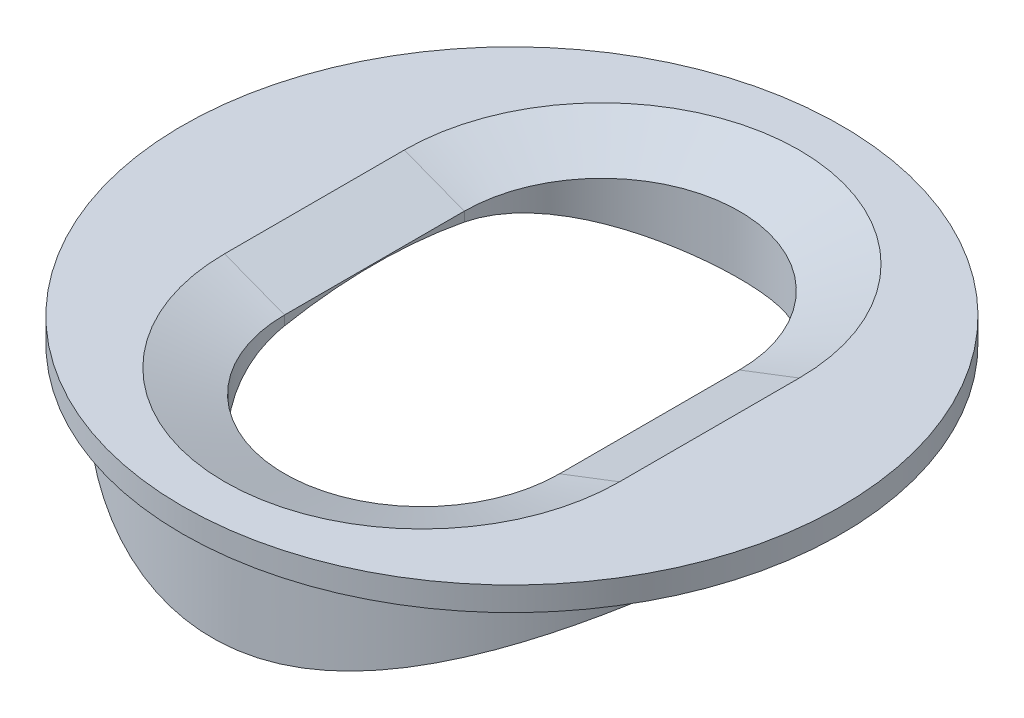
ISO-10303-21;
HEADER;
FILE_DESCRIPTION(('STEP AP214'),'2;1');
FILE_NAME('part.step','',(''),(''),'','','');
FILE_SCHEMA(('AUTOMOTIVE_DESIGN { 1 0 10303 214 1 1 1 1 }'));
ENDSEC;
DATA;
#1=APPLICATION_CONTEXT('core data for automotive mechanical design processes');
#2=APPLICATION_PROTOCOL_DEFINITION('international standard','automotive_design',2000,#1);
#3=PRODUCT_CONTEXT('',#1,'mechanical');
#4=PRODUCT('Part','Part','',(#3));
#5=PRODUCT_RELATED_PRODUCT_CATEGORY('part','',(#4));
#6=PRODUCT_DEFINITION_FORMATION('','',#4);
#7=PRODUCT_DEFINITION_CONTEXT('part definition',#1,'design');
#8=PRODUCT_DEFINITION('design','',#6,#7);
#9=PRODUCT_DEFINITION_SHAPE('','',#8);
#10=(LENGTH_UNIT() NAMED_UNIT(*) SI_UNIT(.MILLI.,.METRE.));
#11=(NAMED_UNIT(*) PLANE_ANGLE_UNIT() SI_UNIT($,.RADIAN.));
#12=(NAMED_UNIT(*) SI_UNIT($,.STERADIAN.) SOLID_ANGLE_UNIT());
#13=UNCERTAINTY_MEASURE_WITH_UNIT(LENGTH_MEASURE(1.E-05),#10,'distance_accuracy_value','');
#14=(GEOMETRIC_REPRESENTATION_CONTEXT(3) GLOBAL_UNCERTAINTY_ASSIGNED_CONTEXT((#13)) GLOBAL_UNIT_ASSIGNED_CONTEXT((#10,
#11,#12)) REPRESENTATION_CONTEXT('',''));
#15=CARTESIAN_POINT('',(0.,0.,0.));
#16=DIRECTION('',(0.,0.,1.));
#17=DIRECTION('',(1.,0.,0.));
#18=AXIS2_PLACEMENT_3D('',#15,#16,#17);
#19=CARTESIAN_POINT('',(0.,5.,0.));
#20=DIRECTION('',(0.,-1.,0.));
#21=DIRECTION('',(0.,0.,-1.));
#22=AXIS2_PLACEMENT_3D('',#19,#20,#21);
#23=CYLINDRICAL_SURFACE('',#22,5.);
#24=CARTESIAN_POINT('',(0.,5.,0.));
#25=DIRECTION('',(0.,1.,0.));
#26=DIRECTION('',(0.,0.,1.));
#27=AXIS2_PLACEMENT_3D('',#24,#25,#26);
#28=CIRCLE('',#27,5.);
#29=CARTESIAN_POINT('',(5.,5.,0.));
#30=VERTEX_POINT('',#29);
#31=CARTESIAN_POINT('',(-5.00000000000012,5.00000000000007,0.));
#32=VERTEX_POINT('',#31);
#33=EDGE_CURVE('E104',#30,#32,#28,.T.);
#34=ORIENTED_EDGE('',*,*,#33,.F.);
#35=CARTESIAN_POINT('',(5.,5.,0.));
#36=CARTESIAN_POINT('',(4.999999703158,4.99999969932038,-0.127079718194144));
#37=CARTESIAN_POINT('',(4.99514877169044,4.99696526438072,-0.254165976353162));
#38=CARTESIAN_POINT('',(4.97581254301626,4.98490163345175,-0.507365681398697));
#39=CARTESIAN_POINT('',(4.96132305932189,4.97586983252038,-0.633478681463028));
#40=CARTESIAN_POINT('',(4.9228878347618,4.95201844653617,-0.883879235580955));
#41=CARTESIAN_POINT('',(4.89892878436801,4.93719071559646,-1.00816396386935));
#42=CARTESIAN_POINT('',(4.8418697843255,4.90210083284868,-1.25388007858571));
#43=CARTESIAN_POINT('',(4.8087659675088,4.88183638204784,-1.3753102342372));
#44=CARTESIAN_POINT('',(4.7340323987006,4.83646507337636,-1.61383677448202));
#45=CARTESIAN_POINT('',(4.69244993505164,4.81138511664483,-1.73095311667823));
#46=CARTESIAN_POINT('',(4.60110152475158,4.75685494898749,-1.96091650164603));
#47=CARTESIAN_POINT('',(4.55133240807103,4.7274030455926,-2.07376186971093));
#48=CARTESIAN_POINT('',(4.39050335799431,4.63340708241437,-2.40491190911409));
#49=CARTESIAN_POINT('',(4.26783654975881,4.5631697348111,-2.61609848167961));
#50=CARTESIAN_POINT('',(3.98444604696249,4.40680295707224,-3.03193014433838));
#51=CARTESIAN_POINT('',(3.82146546344502,4.31985233528323,-3.23470598963289));
#52=CARTESIAN_POINT('',(3.46710060830363,4.1412401292643,-3.61195776992338));
#53=CARTESIAN_POINT('',(3.27567816902114,4.04957232454122,-3.78639500697958));
#54=CARTESIAN_POINT('',(2.95571425020991,3.90836217121019,-4.03551059577151));
#55=CARTESIAN_POINT('',(2.83571286902764,3.85772204075824,-4.12074022592499));
#56=CARTESIAN_POINT('',(2.58784896365527,3.75899646823101,-4.28074637131474));
#57=CARTESIAN_POINT('',(2.4599849735435,3.71091150568103,-4.35552092872511));
#58=CARTESIAN_POINT('',(2.19711581232401,3.61907677956953,-4.49385262588457));
#59=CARTESIAN_POINT('',(2.06212215723772,3.57532033426424,-4.55742717693474));
#60=CARTESIAN_POINT('',(1.78537755230288,3.49385156056842,-4.67278116226383));
#61=CARTESIAN_POINT('',(1.64362658172091,3.45613925072462,-4.72456056034896));
#62=CARTESIAN_POINT('',(1.39186641707947,3.39737739560479,-4.80367778250346));
#63=CARTESIAN_POINT('',(1.28316394558814,3.37454329188128,-4.83387146386473));
#64=CARTESIAN_POINT('',(1.06308085312618,3.33391313113232,-4.8869893698177));
#65=CARTESIAN_POINT('',(0.951700845020764,3.31611593289309,-4.90991524122178));
#66=CARTESIAN_POINT('',(0.727023661660449,3.28619004435451,-4.94817199977536));
#67=CARTESIAN_POINT('',(0.613728926331824,3.27405463174267,-4.96351189515875));
#68=CARTESIAN_POINT('',(0.385858709185192,3.25587655110007,-4.98640391146144));
#69=CARTESIAN_POINT('',(0.271283178348483,3.249834117073,-4.99395573327638));
#70=CARTESIAN_POINT('',(0.0414413461846041,3.24407626191297,-5.00115324292108));
#71=CARTESIAN_POINT('',(-0.0738259597953587,3.24437637846302,-5.00077951510321));
#72=CARTESIAN_POINT('',(-0.303905993516061,3.2513301416873,-4.99208386707443));
#73=CARTESIAN_POINT('',(-0.418718539089885,3.25798611784493,-4.98375903270659));
#74=CARTESIAN_POINT('',(-0.647021081978882,3.27739584443856,-4.95928874246478));
#75=CARTESIAN_POINT('',(-0.760510650571558,3.29015151819107,-4.94314081984502));
#76=CARTESIAN_POINT('',(-0.985386203178625,3.32127805222651,-4.90327193771259));
#77=CARTESIAN_POINT('',(-1.09677129647281,3.33965123599107,-4.87954784440757));
#78=CARTESIAN_POINT('',(-1.42161998429045,3.40129934062341,-4.79874186577055));
#79=CARTESIAN_POINT('',(-1.63129247784869,3.4516270932374,-4.73140686716691));
#80=CARTESIAN_POINT('',(-2.03668208845984,3.565824165778,-4.57160139234777));
#81=CARTESIAN_POINT('',(-2.23239423873349,3.62969827340046,-4.47912202607653));
#82=CARTESIAN_POINT('',(-2.64331465324919,3.77818972806845,-4.25180409904384));
#83=CARTESIAN_POINT('',(-2.85533520228095,3.86445305269834,-4.1122797851601));
#84=CARTESIAN_POINT('',(-3.25534918374023,4.04023909017201,-3.80349790123425));
#85=CARTESIAN_POINT('',(-3.44331757440197,4.12976507734762,-3.63420977102789));
#86=CARTESIAN_POINT('',(-3.7195685480643,4.26825220927601,-3.34462792787133));
#87=CARTESIAN_POINT('',(-3.81674280120393,4.31856628212432,-3.23332743959703));
#88=CARTESIAN_POINT('',(-4.00135111278461,4.4165140520612,-3.00184758289934));
#89=CARTESIAN_POINT('',(-4.0887887482357,4.46414873029401,-2.88167150233174));
#90=CARTESIAN_POINT('',(-4.25323322008513,4.55548277586875,-2.63291547069675));
#91=CARTESIAN_POINT('',(-4.33023729302729,4.59918109959602,-2.50433330649266));
#92=CARTESIAN_POINT('',(-4.47292528813083,4.68138405457136,-2.23953943503378));
#93=CARTESIAN_POINT('',(-4.53861619614163,4.71989188771747,-2.10333250541061));
#94=CARTESIAN_POINT('',(-4.65466886475308,4.78870197133489,-1.83158498937008));
#95=CARTESIAN_POINT('',(-4.70566229777452,4.81933279806533,-1.69639792018988));
#96=CARTESIAN_POINT('',(-4.79602098961896,4.87404113157595,-1.42097512774063));
#97=CARTESIAN_POINT('',(-4.83539289010581,4.89812238079521,-1.28074233969551));
#98=CARTESIAN_POINT('',(-4.90186739840658,4.9389934527939,-0.99648450286852));
#99=CARTESIAN_POINT('',(-4.92898104411324,4.95578983464414,-0.852462989802587));
#100=CARTESIAN_POINT('',(-4.97049034997301,4.98157299247508,-0.561915361707663));
#101=CARTESIAN_POINT('',(-4.98488818263482,4.99056110250213,-0.415389678880739));
#102=CARTESIAN_POINT('',(-4.999520164093,4.99969867025939,-0.143238039189035));
#103=CARTESIAN_POINT('',(-5.00154086408901,5.00096292697891,-0.0177414078568089));
#104=CARTESIAN_POINT('',(-4.9961427784958,4.99758945182604,0.232966367766401));
#105=CARTESIAN_POINT('',(-4.98872461309249,4.9929521077216,0.35817753027276));
#106=CARTESIAN_POINT('',(-4.96455622247317,4.97789005521255,0.607327834496615));
#107=CARTESIAN_POINT('',(-4.94780683435154,4.96746586594014,0.731267089300077));
#108=CARTESIAN_POINT('',(-4.90520930732267,4.94108300214141,0.976969695221646));
#109=CARTESIAN_POINT('',(-4.87936100793997,4.92512423000295,1.09873300792335));
#110=CARTESIAN_POINT('',(-4.82009055280867,4.88877344649023,1.33450834578852));
#111=CARTESIAN_POINT('',(-4.7870073558854,4.86858112898481,1.44863666980924));
#112=CARTESIAN_POINT('',(-4.71311096735755,4.82384532964923,1.67350231741757));
#113=CARTESIAN_POINT('',(-4.67229513929841,4.79930036395891,1.78423846943478));
#114=CARTESIAN_POINT('',(-4.53885022306733,4.71984519521591,2.11043845304158));
#115=CARTESIAN_POINT('',(-4.43517728812057,4.65908557136377,2.32007565393525));
#116=CARTESIAN_POINT('',(-4.1899279363721,4.51959499245697,2.74037159603304));
#117=CARTESIAN_POINT('',(-4.04558186341555,4.43966908727208,2.94899750641245));
#118=CARTESIAN_POINT('',(-3.72882840333277,4.27228030716763,3.34056091506499));
#119=CARTESIAN_POINT('',(-3.55638984261562,4.1848091107345,3.52346945040511));
#120=CARTESIAN_POINT('',(-3.15945503308015,3.99623419569616,3.88590040481164));
#121=CARTESIAN_POINT('',(-2.93103560865682,3.89499476958427,4.06107692783136));
#122=CARTESIAN_POINT('',(-2.44451241557771,3.70267107654715,4.37121122716533));
#123=CARTESIAN_POINT('',(-2.18642937021098,3.61157980658315,4.50619684735977));
#124=CARTESIAN_POINT('',(-1.70118604230814,3.46933988973206,4.70739703071134));
#125=CARTESIAN_POINT('',(-1.47888427189796,3.41382106492075,4.78209607779641));
#126=CARTESIAN_POINT('',(-1.13643451168062,3.34656596743547,4.87056932795047));
#127=CARTESIAN_POINT('',(-1.02080987665685,3.32682054908637,4.89612834571373));
#128=CARTESIAN_POINT('',(-0.787213009902001,3.29335959003546,4.93906627660446));
#129=CARTESIAN_POINT('',(-0.669241811186595,3.27964145480505,4.95644870968554));
#130=CARTESIAN_POINT('',(-0.431062976531056,3.25872646567769,4.98283345322303));
#131=CARTESIAN_POINT('',(-0.31084614919437,3.25156939465669,4.99178464992502));
#132=CARTESIAN_POINT('',(-0.0698650772980838,3.24422754057757,5.00096567028373));
#133=CARTESIAN_POINT('',(0.0508991648452129,3.24404272677361,5.00119553239924));
#134=CARTESIAN_POINT('',(0.291975525811119,3.25065867247708,4.99292458618068));
#135=CARTESIAN_POINT('',(0.412287496131264,3.2574615542391,4.98442112542226));
#136=CARTESIAN_POINT('',(0.65139366298223,3.27774556876195,4.95884706925013));
#137=CARTESIAN_POINT('',(0.77018788090253,3.2912266073017,4.94177659470706));
#138=CARTESIAN_POINT('',(1.10397138997807,3.33822773980263,4.88153513763474));
#139=CARTESIAN_POINT('',(1.31623776002511,3.37907576446225,4.82847742875036));
#140=CARTESIAN_POINT('',(1.728579701154,3.47669777004122,4.69670428935884));
#141=CARTESIAN_POINT('',(1.92865014730156,3.53347839071251,4.61797815957074));
#142=CARTESIAN_POINT('',(2.34237556307302,3.66655793133305,4.42410573147435));
#143=CARTESIAN_POINT('',(2.55380395596853,3.74449249142917,4.30533683658203));
#144=CARTESIAN_POINT('',(2.95575070468091,3.90670498235136,4.04000963034607));
#145=CARTESIAN_POINT('',(3.14625195760183,3.99098800808705,3.89342885237777));
#146=CARTESIAN_POINT('',(3.5400839692072,4.17608994782601,3.54264024371938));
#147=CARTESIAN_POINT('',(3.73847789009049,4.27687640364452,3.33276887019885));
#148=CARTESIAN_POINT('',(4.00810023016022,4.42018359046303,2.99268031590093));
#149=CARTESIAN_POINT('',(4.09337831825354,4.46667962522411,2.87498419390475));
#150=CARTESIAN_POINT('',(4.25391486002553,4.55588019054725,2.63162062416604));
#151=CARTESIAN_POINT('',(4.32917855200336,4.59858669939735,2.50595739502895));
#152=CARTESIAN_POINT('',(4.46910627052635,4.67916888890582,2.24695585117552));
#153=CARTESIAN_POINT('',(4.53374415122623,4.71703260409719,2.11359966396132));
#154=CARTESIAN_POINT('',(4.65135006079646,4.78670745066038,1.8403912735063));
#155=CARTESIAN_POINT('',(4.70432482984781,4.81852207637899,1.70054287903652));
#156=CARTESIAN_POINT('',(4.79771288731285,4.87506644788239,1.41574969186899));
#157=CARTESIAN_POINT('',(4.83815999270725,4.89981525263675,1.27081981592251));
#158=CARTESIAN_POINT('',(4.9059510328588,4.9415135957936,0.97691245346488));
#159=CARTESIAN_POINT('',(4.93330463193524,4.95846888622183,0.827938038321412));
#160=CARTESIAN_POINT('',(4.96918150103186,4.98076605772892,0.565708034628109));
#161=CARTESIAN_POINT('',(4.98072550400174,4.98796542217808,0.453012043961129));
#162=CARTESIAN_POINT('',(4.99613512360569,4.99758267549434,0.226879136348954));
#163=CARTESIAN_POINT('',(5.00000026498644,5.00000026841223,0.113442173980089));
#164=CARTESIAN_POINT('',(5.,5.,0.));
#165=B_SPLINE_CURVE_WITH_KNOTS('',3,(#35,#36,#37,#38,#39,#40,#41,#42,#43,#44,#45,#46,#47,#48,
#49,#50,#51,#52,#53,#54,#55,#56,#57,#58,#59,#60,#61,#62,#63,#64,#65,#66,#67,#68,#69,#70,#71,#72,
#73,#74,#75,#76,#77,#78,#79,#80,#81,#82,#83,#84,#85,#86,#87,#88,#89,#90,#91,#92,#93,#94,#95,#96,
#97,#98,#99,#100,#101,#102,#103,#104,#105,#106,#107,#108,#109,#110,#111,#112,#113,#114,#115,
#116,#117,#118,#119,#120,#121,#122,#123,#124,#125,#126,#127,#128,#129,#130,#131,#132,#133,#134,
#135,#136,#137,#138,#139,#140,#141,#142,#143,#144,#145,#146,#147,#148,#149,#150,#151,#152,#153,
#154,#155,#156,#157,#158,#159,#160,#161,#162,#163,#164),.UNSPECIFIED.,.T.,.F.,(4,2,2,2,2,2,2,2,
2,2,2,2,2,2,2,2,2,2,2,2,2,2,2,2,2,2,2,2,2,2,2,2,2,2,2,2,2,2,2,2,2,2,2,2,2,2,2,2,2,2,2,2,2,2,2,2,
2,2,2,2,2,2,2,2,4),(0.,0.381122813878229,0.762411275945245,1.14423755771083,1.52622555522555,
1.90613865065076,2.2861992035346,3.04547146930923,3.86537873527686,4.68639638614618,
5.15288943324734,5.61946971957747,6.08531814323784,6.55116799634915,6.89615022205285,
7.24105422230075,7.58554766475416,7.9300543371358,8.27540506342305,8.62088241265912,
8.96646876744118,9.31219825544432,9.98712845371038,10.6622975916544,11.463592889512,
12.2657157783383,12.7334704505957,13.2010527095967,13.6687585723722,14.1361745843372,
14.5786070973028,15.0207862699487,15.4625664873666,15.9042712116064,16.280349331717,
16.6564027426817,17.0324224237136,17.4084487368524,17.7696430642803,18.1309607639224,
18.8530325398091,19.6479898222925,20.4438353357779,21.355208937219,22.2659496705469,
22.9857781952855,23.3455439181714,23.705154622762,24.0669316687913,24.4287071194786,
24.7905924786018,25.1524727320855,25.8172983911075,26.482401522191,27.2437925511324,
28.0058012758041,28.9187931910578,29.3761295657643,29.8332257699805,30.2914303932663,
30.7493695182481,31.2060614935589,31.6624158626754,32.0026174741983,32.3428401405226),.UNSPECIFIED.);
#166=EDGE_CURVE('E116',#30,#32,#165,.T.);
#167=ORIENTED_EDGE('',*,*,#166,.T.);
#168=EDGE_LOOP('',(#34,#167));
#169=FACE_BOUND('',#168,.T.);
#170=ADVANCED_FACE('F33',(#169),#23,.T.);
#171=EDGE_CURVE('E123',#32,#30,#28,.T.);
#172=ORIENTED_EDGE('',*,*,#171,.F.);
#173=EDGE_CURVE('E174',#32,#30,#165,.T.);
#174=ORIENTED_EDGE('',*,*,#173,.T.);
#175=EDGE_LOOP('',(#172,#174));
#176=FACE_BOUND('',#175,.T.);
#177=ADVANCED_FACE('F186',(#176),#23,.T.);
#178=CARTESIAN_POINT('',(0.,5.,0.));
#179=DIRECTION('',(0.,1.,0.));
#180=DIRECTION('',(0.,0.,1.));
#181=AXIS2_PLACEMENT_3D('',#178,#179,#180);
#182=PLANE('',#181);
#183=ORIENTED_EDGE('',*,*,#33,.T.);
#184=ORIENTED_EDGE('',*,*,#171,.T.);
#185=EDGE_LOOP('',(#183,#184));
#186=FACE_BOUND('',#185,.T.);
#187=CARTESIAN_POINT('',(0.,5.,0.));
#188=DIRECTION('',(0.,1.,0.));
#189=DIRECTION('',(0.,0.,1.));
#190=AXIS2_PLACEMENT_3D('',#187,#188,#189);
#191=CIRCLE('',#190,5.5);
#192=CARTESIAN_POINT('',(0.,5.,5.5));
#193=VERTEX_POINT('',#192);
#194=EDGE_CURVE('E124',#193,#193,#191,.T.);
#195=ORIENTED_EDGE('',*,*,#194,.F.);
#196=EDGE_LOOP('',(#195));
#197=FACE_BOUND('',#196,.T.);
#198=ADVANCED_FACE('F210',(#186,#197),#182,.F.);
#199=CARTESIAN_POINT('',(0.,5.4,0.));
#200=DIRECTION('',(0.,-1.,0.));
#201=DIRECTION('',(0.,0.,-1.));
#202=AXIS2_PLACEMENT_3D('',#199,#200,#201);
#203=CYLINDRICAL_SURFACE('',#202,5.5);
#204=CARTESIAN_POINT('',(0.,5.4,0.));
#205=DIRECTION('',(0.,1.,0.));
#206=DIRECTION('',(0.,0.,1.));
#207=AXIS2_PLACEMENT_3D('',#204,#205,#206);
#208=CIRCLE('',#207,5.5);
#209=CARTESIAN_POINT('',(0.,5.4,5.5));
#210=VERTEX_POINT('',#209);
#211=EDGE_CURVE('E120',#210,#210,#208,.T.);
#212=ORIENTED_EDGE('',*,*,#211,.F.);
#213=EDGE_LOOP('',(#212));
#214=FACE_BOUND('',#213,.T.);
#215=ORIENTED_EDGE('',*,*,#194,.T.);
#216=EDGE_LOOP('',(#215));
#217=FACE_BOUND('',#216,.T.);
#218=ADVANCED_FACE('F209',(#214,#217),#203,.T.);
#219=CARTESIAN_POINT('',(0.,5.4,0.));
#220=DIRECTION('',(0.,1.,0.));
#221=DIRECTION('',(0.,0.,1.));
#222=AXIS2_PLACEMENT_3D('',#219,#220,#221);
#223=PLANE('',#222);
#224=DIRECTION('',(0.,0.,-1.));
#225=VECTOR('',#224,1.);
#226=CARTESIAN_POINT('',(-3.29525037907764,5.4,-1.5));
#227=LINE('',#226,#225);
#228=CARTESIAN_POINT('',(-3.29525037907764,5.4,1.5));
#229=VERTEX_POINT('',#228);
#230=CARTESIAN_POINT('',(-3.29525037907764,5.4,-1.5));
#231=VERTEX_POINT('',#230);
#232=EDGE_CURVE('E135',#229,#231,#227,.T.);
#233=ORIENTED_EDGE('',*,*,#232,.T.);
#234=CARTESIAN_POINT('',(0.,5.4,-1.5));
#235=DIRECTION('',(0.,1.,0.));
#236=DIRECTION('',(0.,0.,1.));
#237=AXIS2_PLACEMENT_3D('',#234,#235,#236);
#238=CIRCLE('',#237,3.29525037907764);
#239=CARTESIAN_POINT('',(3.29525037907764,5.4,-1.5));
#240=VERTEX_POINT('',#239);
#241=EDGE_CURVE('E137',#231,#240,#238,.F.);
#242=ORIENTED_EDGE('',*,*,#241,.T.);
#243=DIRECTION('',(0.,0.,1.));
#244=VECTOR('',#243,1.);
#245=CARTESIAN_POINT('',(3.29525037907764,5.4,1.5));
#246=LINE('',#245,#244);
#247=CARTESIAN_POINT('',(3.29525037907764,5.4,1.5));
#248=VERTEX_POINT('',#247);
#249=EDGE_CURVE('E133',#240,#248,#246,.T.);
#250=ORIENTED_EDGE('',*,*,#249,.T.);
#251=CARTESIAN_POINT('',(0.,5.4,1.5));
#252=DIRECTION('',(0.,1.,0.));
#253=DIRECTION('',(0.,0.,1.));
#254=AXIS2_PLACEMENT_3D('',#251,#252,#253);
#255=CIRCLE('',#254,3.29525037907764);
#256=EDGE_CURVE('E131',#248,#229,#255,.F.);
#257=ORIENTED_EDGE('',*,*,#256,.T.);
#258=EDGE_LOOP('',(#233,#242,#250,#257));
#259=FACE_BOUND('',#258,.T.);
#260=ORIENTED_EDGE('',*,*,#211,.T.);
#261=EDGE_LOOP('',(#260));
#262=FACE_BOUND('',#261,.T.);
#263=ADVANCED_FACE('F160',(#259,#262),#223,.T.);
#264=CARTESIAN_POINT('',(0.,0.,-1.5));
#265=DIRECTION('',(0.,1.,0.));
#266=DIRECTION('',(0.,0.,1.));
#267=AXIS2_PLACEMENT_3D('',#264,#265,#266);
#268=CYLINDRICAL_SURFACE('',#267,2.29525037907763);
#269=DIRECTION('',(0.,1.,0.));
#270=VECTOR('',#269,1.);
#271=CARTESIAN_POINT('',(2.29525037907763,0.,-1.5));
#272=LINE('',#271,#270);
#273=CARTESIAN_POINT('',(2.29525037907763,4.85811682275085,-1.5));
#274=VERTEX_POINT('',#273);
#275=CARTESIAN_POINT('',(2.29525037907763,5.01613596496458,-1.5));
#276=VERTEX_POINT('',#275);
#277=EDGE_CURVE('E114',#274,#276,#272,.T.);
#278=ORIENTED_EDGE('',*,*,#277,.T.);
#279=CARTESIAN_POINT('',(0.,5.01613596496458,-1.5));
#280=DIRECTION('',(0.,1.,0.));
#281=DIRECTION('',(0.,0.,1.));
#282=AXIS2_PLACEMENT_3D('',#279,#280,#281);
#283=CIRCLE('',#282,2.29525037907763);
#284=CARTESIAN_POINT('',(-2.29525037907763,5.01613596496458,-1.5));
#285=VERTEX_POINT('',#284);
#286=EDGE_CURVE('E103',#276,#285,#283,.T.);
#287=ORIENTED_EDGE('',*,*,#286,.T.);
#288=DIRECTION('',(0.,1.,0.));
#289=VECTOR('',#288,1.);
#290=CARTESIAN_POINT('',(-2.29525037907763,0.,-1.5));
#291=LINE('',#290,#289);
#292=CARTESIAN_POINT('',(-2.29525037907763,4.85811682275085,-1.5));
#293=VERTEX_POINT('',#292);
#294=EDGE_CURVE('E112',#293,#285,#291,.T.);
#295=ORIENTED_EDGE('',*,*,#294,.F.);
#296=CARTESIAN_POINT('',(-2.29525037907763,4.85811682275085,-1.5));
#297=CARTESIAN_POINT('',(-2.2952571552608,4.84550807207698,-1.56609712159402));
#298=CARTESIAN_POINT('',(-2.29239555587178,4.83205197625971,-1.63202034293953));
#299=CARTESIAN_POINT('',(-2.28107554126526,4.8036021473976,-1.7630231256093));
#300=CARTESIAN_POINT('',(-2.27261936789227,4.78860903229631,-1.82810301422564));
#301=CARTESIAN_POINT('',(-2.25028180590214,4.75727659541827,-1.95679329162438));
#302=CARTESIAN_POINT('',(-2.23641595015674,4.74094123271974,-2.02040734033615));
#303=CARTESIAN_POINT('',(-2.20344466722671,4.70708975258268,-2.14592662114018));
#304=CARTESIAN_POINT('',(-2.18433880246412,4.68957353662669,-2.20783171004678));
#305=CARTESIAN_POINT('',(-2.11949307469459,4.63562255990157,-2.39024424779727));
#306=CARTESIAN_POINT('',(-2.06617685371278,4.59771819176748,-2.50772138050419));
#307=CARTESIAN_POINT('',(-1.94102118498045,4.52009711303191,-2.73171184386495));
#308=CARTESIAN_POINT('',(-1.86916649318051,4.48037893317225,-2.83821605022575));
#309=CARTESIAN_POINT('',(-1.70507704079348,4.39978471513908,-3.04232397247792));
#310=CARTESIAN_POINT('',(-1.61208790477664,4.35893409010266,-3.13933407181501));
#311=CARTESIAN_POINT('',(-1.40971116374772,4.28090026609577,-3.31630300404675));
#312=CARTESIAN_POINT('',(-1.3003225379631,4.24371729565442,-3.39626077478238));
#313=CARTESIAN_POINT('',(-1.06900686678961,4.17676387885418,-3.53552998920679));
#314=CARTESIAN_POINT('',(-0.947256736257488,4.14690527647706,-3.59509078573913));
#315=CARTESIAN_POINT('',(-0.693394360144285,4.09722420240453,-3.69221154716713));
#316=CARTESIAN_POINT('',(-0.561293759166616,4.07739063428737,-3.72979584447809));
#317=CARTESIAN_POINT('',(-0.305344922705135,4.05166889572063,-3.77817897098793));
#318=CARTESIAN_POINT('',(-0.182070588118018,4.04454321685755,-3.79136027416555));
#319=CARTESIAN_POINT('',(0.065119171717067,4.04115576989779,-3.797650468052));
#320=CARTESIAN_POINT('',(0.189034310390886,4.04488950486824,-3.79076766739516));
#321=CARTESIAN_POINT('',(0.424028905763865,4.06208537958631,-3.75862078713848));
#322=CARTESIAN_POINT('',(0.535367317459835,4.07478518604484,-3.73479609744877));
#323=CARTESIAN_POINT('',(0.752251786161096,4.10787934788454,-3.67141931453443));
#324=CARTESIAN_POINT('',(0.857796741036358,4.12827516156012,-3.63186424052757));
#325=CARTESIAN_POINT('',(1.065487212492,4.1761730233638,-3.53631310678795));
#326=CARTESIAN_POINT('',(1.16725962022311,4.20395615244825,-3.4796509402613));
#327=CARTESIAN_POINT('',(1.36019837886902,4.2640433857933,-3.35240507233965));
#328=CARTESIAN_POINT('',(1.45136054006122,4.29634926495797,-3.28181590097032));
#329=CARTESIAN_POINT('',(1.63090642270712,4.3670946384391,-3.12001917959208));
#330=CARTESIAN_POINT('',(1.71791229674658,4.40581919206008,-3.02740477820552));
#331=CARTESIAN_POINT('',(1.8754802632725,4.48377805297374,-2.82920634896683));
#332=CARTESIAN_POINT('',(1.94603043158684,4.52301270829758,-2.72361300035945));
#333=CARTESIAN_POINT('',(2.07292211642543,4.60211767750888,-2.49467074557107));
#334=CARTESIAN_POINT('',(2.12807572714928,4.64186993021069,-2.37061991917328));
#335=CARTESIAN_POINT('',(2.21584929677687,4.7168884074319,-2.113635051474));
#336=CARTESIAN_POINT('',(2.248509041463,4.75216246207748,-1.98071715298924));
#337=CARTESIAN_POINT('',(2.27778372131909,4.7977491653465,-1.78845338459322));
#338=CARTESIAN_POINT('',(2.28431895581196,4.81068240459804,-1.73110299160123));
#339=CARTESIAN_POINT('',(2.29304877385546,4.83532857283582,-1.61588677613423));
#340=CARTESIAN_POINT('',(2.29524863094637,4.84704296796232,-1.55802166597599));
#341=CARTESIAN_POINT('',(2.29525037907763,4.85811682275086,-1.5));
#342=B_SPLINE_CURVE_WITH_KNOTS('',3,(#296,#297,#298,#299,#300,#301,#302,#303,#304,#305,#306,
#307,#308,#309,#310,#311,#312,#313,#314,#315,#316,#317,#318,#319,#320,#321,#322,#323,#324,#325,
#326,#327,#328,#329,#330,#331,#332,#333,#334,#335,#336,#337,#338,#339,#340,#341),.UNSPECIFIED.,
.F.,.F.,(4,2,2,2,2,2,2,2,2,2,2,2,2,2,2,2,2,2,2,2,2,2,4),(0.,0.201782145147537,0.403483481563792,
0.604609883565472,0.805753086165825,1.20719583417576,1.60896974361489,2.02832929605582,
2.44771496202813,2.86177350907434,3.27537273746948,3.64588572845798,4.016245310173,
4.35840690138599,4.70063336040623,5.0584292800974,5.41636600857331,5.81318965953407,
6.21029997061412,6.63264701709608,7.05424511001579,7.23155882845902,7.40865672956592),.UNSPECIFIED.);
#343=EDGE_CURVE('E101',#293,#274,#342,.T.);
#344=ORIENTED_EDGE('',*,*,#343,.T.);
#345=EDGE_LOOP('',(#278,#287,#295,#344));
#346=FACE_BOUND('',#345,.T.);
#347=ADVANCED_FACE('F170',(#346),#268,.F.);
#348=CARTESIAN_POINT('',(2.29525037907763,0.,-1.5));
#349=DIRECTION('',(1.,0.,0.));
#350=DIRECTION('',(0.,0.,-1.));
#351=AXIS2_PLACEMENT_3D('',#348,#349,#350);
#352=PLANE('',#351);
#353=DIRECTION('',(0.,1.,0.));
#354=VECTOR('',#353,1.);
#355=CARTESIAN_POINT('',(2.29525037907763,0.,1.5));
#356=LINE('',#355,#354);
#357=CARTESIAN_POINT('',(2.29525037907763,4.85811682275085,1.5));
#358=VERTEX_POINT('',#357);
#359=CARTESIAN_POINT('',(2.29525037907763,5.01613596496458,1.5));
#360=VERTEX_POINT('',#359);
#361=EDGE_CURVE('E108',#358,#360,#356,.T.);
#362=ORIENTED_EDGE('',*,*,#361,.T.);
#363=DIRECTION('',(0.,0.,-1.));
#364=VECTOR('',#363,1.);
#365=CARTESIAN_POINT('',(2.29525037907763,5.01613596496458,-1.5));
#366=LINE('',#365,#364);
#367=EDGE_CURVE('E42',#360,#276,#366,.T.);
#368=ORIENTED_EDGE('',*,*,#367,.T.);
#369=ORIENTED_EDGE('',*,*,#277,.F.);
#370=CARTESIAN_POINT('',(2.29525037907763,-3.,0.));
#371=DIRECTION('',(1.,0.,0.));
#372=DIRECTION('',(0.,0.,-1.));
#373=AXIS2_PLACEMENT_3D('',#370,#371,#372);
#374=CIRCLE('',#373,8.);
#375=EDGE_CURVE('E109',#274,#358,#374,.T.);
#376=ORIENTED_EDGE('',*,*,#375,.T.);
#377=EDGE_LOOP('',(#362,#368,#369,#376));
#378=FACE_BOUND('',#377,.T.);
#379=ADVANCED_FACE('F193',(#378),#352,.F.);
#380=CARTESIAN_POINT('',(0.,0.,1.5));
#381=DIRECTION('',(0.,1.,0.));
#382=DIRECTION('',(0.,0.,1.));
#383=AXIS2_PLACEMENT_3D('',#380,#381,#382);
#384=CYLINDRICAL_SURFACE('',#383,2.29525037907763);
#385=DIRECTION('',(0.,1.,0.));
#386=VECTOR('',#385,1.);
#387=CARTESIAN_POINT('',(-2.29525037907763,0.,1.5));
#388=LINE('',#387,#386);
#389=CARTESIAN_POINT('',(-2.29525037907763,4.85811682275085,1.5));
#390=VERTEX_POINT('',#389);
#391=CARTESIAN_POINT('',(-2.29525037907763,5.01613596496458,1.5));
#392=VERTEX_POINT('',#391);
#393=EDGE_CURVE('E107',#390,#392,#388,.T.);
#394=ORIENTED_EDGE('',*,*,#393,.T.);
#395=CARTESIAN_POINT('',(0.,5.01613596496458,1.5));
#396=DIRECTION('',(0.,1.,0.));
#397=DIRECTION('',(0.,0.,1.));
#398=AXIS2_PLACEMENT_3D('',#395,#396,#397);
#399=CIRCLE('',#398,2.29525037907763);
#400=EDGE_CURVE('E11',#392,#360,#399,.T.);
#401=ORIENTED_EDGE('',*,*,#400,.T.);
#402=ORIENTED_EDGE('',*,*,#361,.F.);
#403=CARTESIAN_POINT('',(2.29525037907763,4.85811682275085,1.5));
#404=CARTESIAN_POINT('',(2.2952571552608,4.84550807207698,1.56609712159402));
#405=CARTESIAN_POINT('',(2.29239555587178,4.83205197625971,1.63202034293953));
#406=CARTESIAN_POINT('',(2.28107554126526,4.8036021473976,1.7630231256093));
#407=CARTESIAN_POINT('',(2.27261936789227,4.78860903229631,1.82810301422564));
#408=CARTESIAN_POINT('',(2.25028180590214,4.75727659541827,1.95679329162438));
#409=CARTESIAN_POINT('',(2.23641595015674,4.74094123271974,2.02040734033615));
#410=CARTESIAN_POINT('',(2.20344466722671,4.70708975258268,2.14592662114018));
#411=CARTESIAN_POINT('',(2.18433880246412,4.68957353662669,2.20783171004678));
#412=CARTESIAN_POINT('',(2.11949307469459,4.63562255990157,2.39024424779727));
#413=CARTESIAN_POINT('',(2.06617685371278,4.59771819176748,2.50772138050419));
#414=CARTESIAN_POINT('',(1.94102118498045,4.52009711303191,2.73171184386495));
#415=CARTESIAN_POINT('',(1.86916649318051,4.48037893317225,2.83821605022575));
#416=CARTESIAN_POINT('',(1.70507704079348,4.39978471513908,3.04232397247792));
#417=CARTESIAN_POINT('',(1.61208790477664,4.35893409010266,3.13933407181501));
#418=CARTESIAN_POINT('',(1.40971116374773,4.28090026609577,3.31630300404675));
#419=CARTESIAN_POINT('',(1.3003225379631,4.24371729565442,3.39626077478238));
#420=CARTESIAN_POINT('',(1.06900686678961,4.17676387885418,3.53552998920679));
#421=CARTESIAN_POINT('',(0.947256736257489,4.14690527647706,3.59509078573913));
#422=CARTESIAN_POINT('',(0.693394360144285,4.09722420240454,3.69221154716713));
#423=CARTESIAN_POINT('',(0.561293759166616,4.07739063428737,3.72979584447809));
#424=CARTESIAN_POINT('',(0.305344922705135,4.05166889572063,3.77817897098793));
#425=CARTESIAN_POINT('',(0.182070588118019,4.04454321685755,3.79136027416555));
#426=CARTESIAN_POINT('',(-0.0651191717170666,4.04115576989779,3.797650468052));
#427=CARTESIAN_POINT('',(-0.189034310390885,4.04488950486824,3.79076766739516));
#428=CARTESIAN_POINT('',(-0.424028905763864,4.06208537958631,3.75862078713848));
#429=CARTESIAN_POINT('',(-0.535367317459834,4.07478518604484,3.73479609744877));
#430=CARTESIAN_POINT('',(-0.752251786161095,4.10787934788454,3.67141931453443));
#431=CARTESIAN_POINT('',(-0.857796741036358,4.12827516156011,3.63186424052757));
#432=CARTESIAN_POINT('',(-1.065487212492,4.1761730233638,3.53631310678795));
#433=CARTESIAN_POINT('',(-1.16725962022311,4.20395615244825,3.4796509402613));
#434=CARTESIAN_POINT('',(-1.36019837886902,4.2640433857933,3.35240507233965));
#435=CARTESIAN_POINT('',(-1.45136054006122,4.29634926495796,3.28181590097032));
#436=CARTESIAN_POINT('',(-1.63090642270712,4.3670946384391,3.12001917959208));
#437=CARTESIAN_POINT('',(-1.71791229674658,4.40581919206007,3.02740477820552));
#438=CARTESIAN_POINT('',(-1.8754802632725,4.48377805297374,2.82920634896683));
#439=CARTESIAN_POINT('',(-1.94603043158684,4.52301270829758,2.72361300035945));
#440=CARTESIAN_POINT('',(-2.07292211642543,4.60211767750888,2.49467074557107));
#441=CARTESIAN_POINT('',(-2.12807572714927,4.64186993021069,2.37061991917328));
#442=CARTESIAN_POINT('',(-2.21584929677687,4.7168884074319,2.113635051474));
#443=CARTESIAN_POINT('',(-2.248509041463,4.75216246207748,1.98071715298924));
#444=CARTESIAN_POINT('',(-2.27778372131909,4.7977491653465,1.78845338459322));
#445=CARTESIAN_POINT('',(-2.28431895581196,4.81068240459804,1.73110299160123));
#446=CARTESIAN_POINT('',(-2.29304877385546,4.83532857283582,1.61588677613423));
#447=CARTESIAN_POINT('',(-2.29524863094637,4.84704296796232,1.55802166597598));
#448=CARTESIAN_POINT('',(-2.29525037907763,4.85811682275086,1.5));
#449=B_SPLINE_CURVE_WITH_KNOTS('',3,(#403,#404,#405,#406,#407,#408,#409,#410,#411,#412,#413,
#414,#415,#416,#417,#418,#419,#420,#421,#422,#423,#424,#425,#426,#427,#428,#429,#430,#431,#432,
#433,#434,#435,#436,#437,#438,#439,#440,#441,#442,#443,#444,#445,#446,#447,#448),.UNSPECIFIED.,
.F.,.F.,(4,2,2,2,2,2,2,2,2,2,2,2,2,2,2,2,2,2,2,2,2,2,4),(0.,0.201782145147537,0.403483481563791,
0.604609883565472,0.805753086165824,1.20719583417576,1.60896974361489,2.02832929605582,
2.44771496202812,2.86177350907434,3.27537273746948,3.64588572845798,4.016245310173,
4.35840690138599,4.70063336040623,5.0584292800974,5.41636600857331,5.81318965953407,
6.21029997061412,6.63264701709608,7.05424511001579,7.23155882845902,7.40865672956592),.UNSPECIFIED.);
#450=EDGE_CURVE('E98',#358,#390,#449,.T.);
#451=ORIENTED_EDGE('',*,*,#450,.T.);
#452=EDGE_LOOP('',(#394,#401,#402,#451));
#453=FACE_BOUND('',#452,.T.);
#454=ADVANCED_FACE('F106',(#453),#384,.F.);
#455=CARTESIAN_POINT('',(-2.29525037907763,0.,-1.5));
#456=DIRECTION('',(-1.,0.,0.));
#457=DIRECTION('',(0.,0.,1.));
#458=AXIS2_PLACEMENT_3D('',#455,#456,#457);
#459=PLANE('',#458);
#460=ORIENTED_EDGE('',*,*,#294,.T.);
#461=DIRECTION('',(0.,0.,1.));
#462=VECTOR('',#461,1.);
#463=CARTESIAN_POINT('',(-2.29525037907763,5.01613596496458,1.5));
#464=LINE('',#463,#462);
#465=EDGE_CURVE('E56',#285,#392,#464,.T.);
#466=ORIENTED_EDGE('',*,*,#465,.T.);
#467=ORIENTED_EDGE('',*,*,#393,.F.);
#468=CARTESIAN_POINT('',(-2.29525037907763,-3.,0.));
#469=DIRECTION('',(-1.,0.,0.));
#470=DIRECTION('',(0.,0.,1.));
#471=AXIS2_PLACEMENT_3D('',#468,#469,#470);
#472=CIRCLE('',#471,8.);
#473=EDGE_CURVE('E94',#390,#293,#472,.T.);
#474=ORIENTED_EDGE('',*,*,#473,.T.);
#475=EDGE_LOOP('',(#460,#466,#467,#474));
#476=FACE_BOUND('',#475,.T.);
#477=ADVANCED_FACE('F111',(#476),#459,.F.);
#478=CARTESIAN_POINT('',(-5.5,-3.,0.));
#479=DIRECTION('',(1.,0.,0.));
#480=DIRECTION('',(0.,0.,-1.));
#481=AXIS2_PLACEMENT_3D('',#478,#479,#480);
#482=CYLINDRICAL_SURFACE('',#481,8.);
#483=ORIENTED_EDGE('',*,*,#473,.F.);
#484=ORIENTED_EDGE('',*,*,#450,.F.);
#485=ORIENTED_EDGE('',*,*,#375,.F.);
#486=ORIENTED_EDGE('',*,*,#343,.F.);
#487=EDGE_LOOP('',(#483,#484,#485,#486));
#488=FACE_BOUND('',#487,.T.);
#489=ORIENTED_EDGE('',*,*,#173,.F.);
#490=ORIENTED_EDGE('',*,*,#166,.F.);
#491=EDGE_LOOP('',(#489,#490));
#492=FACE_BOUND('',#491,.T.);
#493=ADVANCED_FACE('F96',(#488,#492),#482,.F.);
#494=CARTESIAN_POINT('',(0.,5.01613596496458,1.5));
#495=DIRECTION('',(0.,1.,0.));
#496=DIRECTION('',(0.,0.,1.));
#497=AXIS2_PLACEMENT_3D('',#494,#495,#496);
#498=CONICAL_SURFACE('',#497,2.29525037907763,1.20427718387609);
#499=DIRECTION('',(0.933580426497203,-0.358367949545298,0.));
#500=VECTOR('',#499,1.);
#501=CARTESIAN_POINT('',(-3.29525037907764,5.4,1.5));
#502=LINE('',#501,#500);
#503=EDGE_CURVE('E145',#229,#392,#502,.T.);
#504=ORIENTED_EDGE('',*,*,#503,.F.);
#505=ORIENTED_EDGE('',*,*,#256,.F.);
#506=DIRECTION('',(0.933580426497203,0.358367949545298,0.));
#507=VECTOR('',#506,1.);
#508=CARTESIAN_POINT('',(2.29525037907763,5.01613596496458,1.5));
#509=LINE('',#508,#507);
#510=EDGE_CURVE('E37',#360,#248,#509,.T.);
#511=ORIENTED_EDGE('',*,*,#510,.F.);
#512=ORIENTED_EDGE('',*,*,#400,.F.);
#513=EDGE_LOOP('',(#504,#505,#511,#512));
#514=FACE_BOUND('',#513,.T.);
#515=ADVANCED_FACE('F35',(#514),#498,.F.);
#516=CARTESIAN_POINT('',(2.29525037907763,5.01613596496458,-1.5));
#517=DIRECTION('',(-0.358367949545297,0.933580426497203,0.));
#518=DIRECTION('',(-0.933580426497203,-0.358367949545297,0.));
#519=AXIS2_PLACEMENT_3D('',#516,#517,#518);
#520=PLANE('',#519);
#521=ORIENTED_EDGE('',*,*,#510,.T.);
#522=ORIENTED_EDGE('',*,*,#249,.F.);
#523=DIRECTION('',(0.933580426497203,0.358367949545297,0.));
#524=VECTOR('',#523,1.);
#525=CARTESIAN_POINT('',(2.29525037907763,5.01613596496458,-1.5));
#526=LINE('',#525,#524);
#527=EDGE_CURVE('E144',#276,#240,#526,.T.);
#528=ORIENTED_EDGE('',*,*,#527,.F.);
#529=ORIENTED_EDGE('',*,*,#367,.F.);
#530=EDGE_LOOP('',(#521,#522,#528,#529));
#531=FACE_BOUND('',#530,.T.);
#532=ADVANCED_FACE('F155',(#531),#520,.T.);
#533=CARTESIAN_POINT('',(-2.29525037907763,5.01613596496458,-1.5));
#534=DIRECTION('',(0.358367949545297,0.933580426497203,0.));
#535=DIRECTION('',(-0.933580426497203,0.358367949545297,0.));
#536=AXIS2_PLACEMENT_3D('',#533,#534,#535);
#537=PLANE('',#536);
#538=ORIENTED_EDGE('',*,*,#503,.T.);
#539=ORIENTED_EDGE('',*,*,#465,.F.);
#540=DIRECTION('',(0.933580426497203,-0.358367949545297,0.));
#541=VECTOR('',#540,1.);
#542=CARTESIAN_POINT('',(-3.29525037907764,5.4,-1.5));
#543=LINE('',#542,#541);
#544=EDGE_CURVE('E142',#231,#285,#543,.T.);
#545=ORIENTED_EDGE('',*,*,#544,.F.);
#546=ORIENTED_EDGE('',*,*,#232,.F.);
#547=EDGE_LOOP('',(#538,#539,#545,#546));
#548=FACE_BOUND('',#547,.T.);
#549=ADVANCED_FACE('F167',(#548),#537,.T.);
#550=CARTESIAN_POINT('',(0.,5.01613596496458,-1.5));
#551=DIRECTION('',(0.,1.,0.));
#552=DIRECTION('',(0.,0.,1.));
#553=AXIS2_PLACEMENT_3D('',#550,#551,#552);
#554=CONICAL_SURFACE('',#553,2.29525037907763,1.20427718387609);
#555=ORIENTED_EDGE('',*,*,#527,.T.);
#556=ORIENTED_EDGE('',*,*,#241,.F.);
#557=ORIENTED_EDGE('',*,*,#544,.T.);
#558=ORIENTED_EDGE('',*,*,#286,.F.);
#559=EDGE_LOOP('',(#555,#556,#557,#558));
#560=FACE_BOUND('',#559,.T.);
#561=ADVANCED_FACE('F165',(#560),#554,.F.);
#562=CLOSED_SHELL('',(#170,#177,#198,#218,#263,#347,#379,#454,#477,#493,#515,#532,#549,#561));
#563=MANIFOLD_SOLID_BREP('B2',#562);
#564=ADVANCED_BREP_SHAPE_REPRESENTATION('',(#18,#563),#14);
#565=SHAPE_DEFINITION_REPRESENTATION(#9,#564);
ENDSEC;
END-ISO-10303-21;
